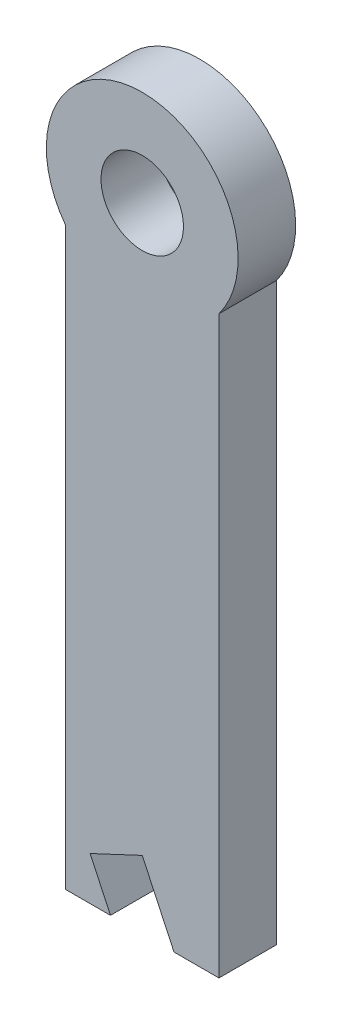
ISO-10303-21;
HEADER;
FILE_DESCRIPTION(('STEP AP214'),'2;1');
FILE_NAME('part.step','',(''),(''),'','','');
FILE_SCHEMA(('AUTOMOTIVE_DESIGN { 1 0 10303 214 1 1 1 1 }'));
ENDSEC;
DATA;
#1=APPLICATION_CONTEXT('core data for automotive mechanical design processes');
#2=APPLICATION_PROTOCOL_DEFINITION('international standard','automotive_design',2000,#1);
#3=PRODUCT_CONTEXT('',#1,'mechanical');
#4=PRODUCT('Part','Part','',(#3));
#5=PRODUCT_RELATED_PRODUCT_CATEGORY('part','',(#4));
#6=PRODUCT_DEFINITION_FORMATION('','',#4);
#7=PRODUCT_DEFINITION_CONTEXT('part definition',#1,'design');
#8=PRODUCT_DEFINITION('design','',#6,#7);
#9=PRODUCT_DEFINITION_SHAPE('','',#8);
#10=(LENGTH_UNIT() NAMED_UNIT(*) SI_UNIT(.MILLI.,.METRE.));
#11=(NAMED_UNIT(*) PLANE_ANGLE_UNIT() SI_UNIT($,.RADIAN.));
#12=(NAMED_UNIT(*) SI_UNIT($,.STERADIAN.) SOLID_ANGLE_UNIT());
#13=UNCERTAINTY_MEASURE_WITH_UNIT(LENGTH_MEASURE(1.E-05),#10,'distance_accuracy_value','');
#14=(GEOMETRIC_REPRESENTATION_CONTEXT(3) GLOBAL_UNCERTAINTY_ASSIGNED_CONTEXT((#13)) GLOBAL_UNIT_ASSIGNED_CONTEXT((#10,
#11,#12)) REPRESENTATION_CONTEXT('',''));
#15=CARTESIAN_POINT('',(0.,0.,0.));
#16=DIRECTION('',(0.,0.,1.));
#17=DIRECTION('',(1.,0.,0.));
#18=AXIS2_PLACEMENT_3D('',#15,#16,#17);
#19=CARTESIAN_POINT('',(4.,0.,3.));
#20=DIRECTION('',(1.,0.,0.));
#21=DIRECTION('',(0.,1.,0.));
#22=AXIS2_PLACEMENT_3D('',#19,#20,#21);
#23=PLANE('',#22);
#24=DIRECTION('',(0.,-1.,0.));
#25=VECTOR('',#24,1.);
#26=CARTESIAN_POINT('',(4.,0.,0.));
#27=LINE('',#26,#25);
#28=CARTESIAN_POINT('',(4.,-3.,0.));
#29=VERTEX_POINT('',#28);
#30=CARTESIAN_POINT('',(4.00000000000001,-33.,0.));
#31=VERTEX_POINT('',#30);
#32=EDGE_CURVE('E132',#29,#31,#27,.T.);
#33=ORIENTED_EDGE('',*,*,#32,.F.);
#34=DIRECTION('',(0.,0.,-1.));
#35=VECTOR('',#34,1.);
#36=CARTESIAN_POINT('',(4.,-3.,3.));
#37=LINE('',#36,#35);
#38=CARTESIAN_POINT('',(4.,-3.,3.));
#39=VERTEX_POINT('',#38);
#40=EDGE_CURVE('E11',#39,#29,#37,.T.);
#41=ORIENTED_EDGE('',*,*,#40,.F.);
#42=DIRECTION('',(0.,-1.,0.));
#43=VECTOR('',#42,1.);
#44=CARTESIAN_POINT('',(4.,0.,3.));
#45=LINE('',#44,#43);
#46=CARTESIAN_POINT('',(4.00000000000001,-33.,3.));
#47=VERTEX_POINT('',#46);
#48=EDGE_CURVE('E207',#39,#47,#45,.T.);
#49=ORIENTED_EDGE('',*,*,#48,.T.);
#50=DIRECTION('',(0.,0.,-1.));
#51=VECTOR('',#50,1.);
#52=CARTESIAN_POINT('',(4.00000000000001,-33.,3.));
#53=LINE('',#52,#51);
#54=EDGE_CURVE('E52',#47,#31,#53,.T.);
#55=ORIENTED_EDGE('',*,*,#54,.T.);
#56=EDGE_LOOP('',(#33,#41,#49,#55));
#57=FACE_BOUND('',#56,.T.);
#58=ADVANCED_FACE('F35',(#57),#23,.T.);
#59=CARTESIAN_POINT('',(0.,0.,3.));
#60=DIRECTION('',(0.,0.,-1.));
#61=DIRECTION('',(-1.,0.,0.));
#62=AXIS2_PLACEMENT_3D('',#59,#60,#61);
#63=CYLINDRICAL_SURFACE('',#62,5.);
#64=CARTESIAN_POINT('',(0.,0.,0.));
#65=DIRECTION('',(0.,0.,1.));
#66=DIRECTION('',(1.,0.,0.));
#67=AXIS2_PLACEMENT_3D('',#64,#65,#66);
#68=CIRCLE('',#67,5.);
#69=CARTESIAN_POINT('',(-4.,-2.99999999999999,0.));
#70=VERTEX_POINT('',#69);
#71=EDGE_CURVE('E134',#29,#70,#68,.T.);
#72=ORIENTED_EDGE('',*,*,#71,.T.);
#73=DIRECTION('',(0.,0.,-1.));
#74=VECTOR('',#73,1.);
#75=CARTESIAN_POINT('',(-4.,-2.99999999999999,3.));
#76=LINE('',#75,#74);
#77=CARTESIAN_POINT('',(-4.,-2.99999999999999,3.));
#78=VERTEX_POINT('',#77);
#79=EDGE_CURVE('E44',#78,#70,#76,.T.);
#80=ORIENTED_EDGE('',*,*,#79,.F.);
#81=CARTESIAN_POINT('',(0.,0.,3.));
#82=DIRECTION('',(0.,0.,1.));
#83=DIRECTION('',(1.,0.,0.));
#84=AXIS2_PLACEMENT_3D('',#81,#82,#83);
#85=CIRCLE('',#84,5.);
#86=EDGE_CURVE('E209',#39,#78,#85,.T.);
#87=ORIENTED_EDGE('',*,*,#86,.F.);
#88=ORIENTED_EDGE('',*,*,#40,.T.);
#89=EDGE_LOOP('',(#72,#80,#87,#88));
#90=FACE_BOUND('',#89,.T.);
#91=ADVANCED_FACE('F171',(#90),#63,.T.);
#92=CARTESIAN_POINT('',(-4.,0.,3.));
#93=DIRECTION('',(1.,0.,0.));
#94=DIRECTION('',(0.,1.,0.));
#95=AXIS2_PLACEMENT_3D('',#92,#93,#94);
#96=PLANE('',#95);
#97=DIRECTION('',(0.,-1.,0.));
#98=VECTOR('',#97,1.);
#99=CARTESIAN_POINT('',(-4.,0.,0.));
#100=LINE('',#99,#98);
#101=CARTESIAN_POINT('',(-4.,-33.,0.));
#102=VERTEX_POINT('',#101);
#103=EDGE_CURVE('E137',#70,#102,#100,.T.);
#104=ORIENTED_EDGE('',*,*,#103,.T.);
#105=DIRECTION('',(0.,0.,-1.));
#106=VECTOR('',#105,1.);
#107=CARTESIAN_POINT('',(-4.,-33.,3.));
#108=LINE('',#107,#106);
#109=CARTESIAN_POINT('',(-4.,-33.,3.));
#110=VERTEX_POINT('',#109);
#111=EDGE_CURVE('E159',#110,#102,#108,.T.);
#112=ORIENTED_EDGE('',*,*,#111,.F.);
#113=DIRECTION('',(0.,-1.,0.));
#114=VECTOR('',#113,1.);
#115=CARTESIAN_POINT('',(-4.,0.,3.));
#116=LINE('',#115,#114);
#117=EDGE_CURVE('E167',#78,#110,#116,.T.);
#118=ORIENTED_EDGE('',*,*,#117,.F.);
#119=ORIENTED_EDGE('',*,*,#79,.T.);
#120=EDGE_LOOP('',(#104,#112,#118,#119));
#121=FACE_BOUND('',#120,.T.);
#122=ADVANCED_FACE('F164',(#121),#96,.F.);
#123=CARTESIAN_POINT('',(-3.90820144314285E-13,-33.,3.));
#124=DIRECTION('',(0.,1.,0.));
#125=DIRECTION('',(-1.,0.,0.));
#126=AXIS2_PLACEMENT_3D('',#123,#124,#125);
#127=PLANE('',#126);
#128=DIRECTION('',(1.,0.,0.));
#129=VECTOR('',#128,1.);
#130=CARTESIAN_POINT('',(-3.90820144314285E-13,-33.,0.));
#131=LINE('',#130,#129);
#132=CARTESIAN_POINT('',(-1.65637977304673,-33.,0.));
#133=VERTEX_POINT('',#132);
#134=EDGE_CURVE('E140',#102,#133,#131,.T.);
#135=ORIENTED_EDGE('',*,*,#134,.T.);
#136=DIRECTION('',(0.,0.,-1.));
#137=VECTOR('',#136,1.);
#138=CARTESIAN_POINT('',(-1.65637977304673,-33.,3.));
#139=LINE('',#138,#137);
#140=CARTESIAN_POINT('',(-1.65637977304673,-33.,3.));
#141=VERTEX_POINT('',#140);
#142=EDGE_CURVE('E156',#141,#133,#139,.T.);
#143=ORIENTED_EDGE('',*,*,#142,.F.);
#144=DIRECTION('',(1.,0.,0.));
#145=VECTOR('',#144,1.);
#146=CARTESIAN_POINT('',(-3.90820144314285E-13,-33.,3.));
#147=LINE('',#146,#145);
#148=EDGE_CURVE('E214',#110,#141,#147,.T.);
#149=ORIENTED_EDGE('',*,*,#148,.F.);
#150=ORIENTED_EDGE('',*,*,#111,.T.);
#151=EDGE_LOOP('',(#135,#143,#149,#150));
#152=FACE_BOUND('',#151,.T.);
#153=ADVANCED_FACE('F182',(#152),#127,.F.);
#154=CARTESIAN_POINT('',(-14.0340352451924,-6.57319049991088,3.));
#155=DIRECTION('',(-0.905589421223677,-0.424155396249731,0.));
#156=DIRECTION('',(0.424155396249731,-0.905589421223677,0.));
#157=AXIS2_PLACEMENT_3D('',#154,#155,#156);
#158=PLANE('',#157);
#159=DIRECTION('',(-0.424155396249731,0.905589421223677,0.));
#160=VECTOR('',#159,1.);
#161=CARTESIAN_POINT('',(-14.0340352451924,-6.57319049991088,0.));
#162=LINE('',#161,#160);
#163=CARTESIAN_POINT('',(-2.71676826367106,-30.7360264469408,0.));
#164=VERTEX_POINT('',#163);
#165=EDGE_CURVE('E143',#133,#164,#162,.T.);
#166=ORIENTED_EDGE('',*,*,#165,.T.);
#167=DIRECTION('',(0.,0.,-1.));
#168=VECTOR('',#167,1.);
#169=CARTESIAN_POINT('',(-2.71676826367106,-30.7360264469408,3.));
#170=LINE('',#169,#168);
#171=CARTESIAN_POINT('',(-2.71676826367106,-30.7360264469408,3.));
#172=VERTEX_POINT('',#171);
#173=EDGE_CURVE('E111',#172,#164,#170,.T.);
#174=ORIENTED_EDGE('',*,*,#173,.F.);
#175=DIRECTION('',(-0.424155396249731,0.905589421223677,0.));
#176=VECTOR('',#175,1.);
#177=CARTESIAN_POINT('',(-14.0340352451924,-6.57319049991088,3.));
#178=LINE('',#177,#176);
#179=EDGE_CURVE('E120',#141,#172,#178,.T.);
#180=ORIENTED_EDGE('',*,*,#179,.F.);
#181=ORIENTED_EDGE('',*,*,#142,.T.);
#182=EDGE_LOOP('',(#166,#174,#180,#181));
#183=FACE_BOUND('',#182,.T.);
#184=ADVANCED_FACE('F185',(#183),#158,.F.);
#185=CARTESIAN_POINT('',(11.3172669815211,-24.1628359470303,3.));
#186=DIRECTION('',(0.424155396249719,-0.905589421223682,0.));
#187=DIRECTION('',(0.905589421223682,0.424155396249719,0.));
#188=AXIS2_PLACEMENT_3D('',#185,#186,#187);
#189=PLANE('',#188);
#190=DIRECTION('',(-0.905589421223682,-0.424155396249719,0.));
#191=VECTOR('',#190,1.);
#192=CARTESIAN_POINT('',(11.3172669815211,-24.1628359470303,0.));
#193=LINE('',#192,#191);
#194=CARTESIAN_POINT('',(0.,-29.4635602581916,0.));
#195=VERTEX_POINT('',#194);
#196=EDGE_CURVE('E107',#195,#164,#193,.T.);
#197=ORIENTED_EDGE('',*,*,#196,.F.);
#198=DIRECTION('',(0.,0.,-1.));
#199=VECTOR('',#198,1.);
#200=CARTESIAN_POINT('',(0.,-29.4635602581916,3.));
#201=LINE('',#200,#199);
#202=CARTESIAN_POINT('',(0.,-29.4635602581916,3.));
#203=VERTEX_POINT('',#202);
#204=EDGE_CURVE('E102',#203,#195,#201,.T.);
#205=ORIENTED_EDGE('',*,*,#204,.F.);
#206=DIRECTION('',(-0.905589421223682,-0.424155396249719,0.));
#207=VECTOR('',#206,1.);
#208=CARTESIAN_POINT('',(11.3172669815211,-24.1628359470303,3.));
#209=LINE('',#208,#207);
#210=EDGE_CURVE('E105',#203,#172,#209,.T.);
#211=ORIENTED_EDGE('',*,*,#210,.T.);
#212=ORIENTED_EDGE('',*,*,#173,.T.);
#213=EDGE_LOOP('',(#197,#205,#211,#212));
#214=FACE_BOUND('',#213,.T.);
#215=ADVANCED_FACE('F104',(#214),#189,.T.);
#216=CARTESIAN_POINT('',(-11.3172669815212,-5.3007243111615,3.));
#217=DIRECTION('',(-0.90558942122368,-0.424155396249724,0.));
#218=DIRECTION('',(0.424155396249724,-0.90558942122368,0.));
#219=AXIS2_PLACEMENT_3D('',#216,#217,#218);
#220=PLANE('',#219);
#221=DIRECTION('',(-0.424155396249724,0.90558942122368,0.));
#222=VECTOR('',#221,1.);
#223=CARTESIAN_POINT('',(-11.3172669815212,-5.3007243111615,0.));
#224=LINE('',#223,#222);
#225=CARTESIAN_POINT('',(1.65637977304672,-33.,0.));
#226=VERTEX_POINT('',#225);
#227=EDGE_CURVE('E147',#226,#195,#224,.T.);
#228=ORIENTED_EDGE('',*,*,#227,.F.);
#229=DIRECTION('',(0.,0.,-1.));
#230=VECTOR('',#229,1.);
#231=CARTESIAN_POINT('',(1.65637977304672,-33.,3.));
#232=LINE('',#231,#230);
#233=CARTESIAN_POINT('',(1.65637977304672,-33.,3.));
#234=VERTEX_POINT('',#233);
#235=EDGE_CURVE('E77',#234,#226,#232,.T.);
#236=ORIENTED_EDGE('',*,*,#235,.F.);
#237=DIRECTION('',(-0.424155396249724,0.90558942122368,0.));
#238=VECTOR('',#237,1.);
#239=CARTESIAN_POINT('',(-11.3172669815212,-5.3007243111615,3.));
#240=LINE('',#239,#238);
#241=EDGE_CURVE('E118',#234,#203,#240,.T.);
#242=ORIENTED_EDGE('',*,*,#241,.T.);
#243=ORIENTED_EDGE('',*,*,#204,.T.);
#244=EDGE_LOOP('',(#228,#236,#242,#243));
#245=FACE_BOUND('',#244,.T.);
#246=ADVANCED_FACE('F123',(#245),#220,.T.);
#247=CARTESIAN_POINT('',(0.,0.,3.));
#248=DIRECTION('',(0.,0.,-1.));
#249=DIRECTION('',(-1.,0.,0.));
#250=AXIS2_PLACEMENT_3D('',#247,#248,#249);
#251=CYLINDRICAL_SURFACE('',#250,2.15);
#252=CARTESIAN_POINT('',(0.,0.,3.));
#253=DIRECTION('',(0.,0.,1.));
#254=DIRECTION('',(1.,0.,0.));
#255=AXIS2_PLACEMENT_3D('',#252,#253,#254);
#256=CIRCLE('',#255,2.15);
#257=CARTESIAN_POINT('',(2.15,0.,3.));
#258=VERTEX_POINT('',#257);
#259=EDGE_CURVE('E152',#258,#258,#256,.T.);
#260=ORIENTED_EDGE('',*,*,#259,.T.);
#261=EDGE_LOOP('',(#260));
#262=FACE_BOUND('',#261,.T.);
#263=CARTESIAN_POINT('',(0.,0.,0.));
#264=DIRECTION('',(0.,0.,1.));
#265=DIRECTION('',(1.,0.,0.));
#266=AXIS2_PLACEMENT_3D('',#263,#264,#265);
#267=CIRCLE('',#266,2.15);
#268=CARTESIAN_POINT('',(2.15,0.,0.));
#269=VERTEX_POINT('',#268);
#270=EDGE_CURVE('E129',#269,#269,#267,.T.);
#271=ORIENTED_EDGE('',*,*,#270,.F.);
#272=EDGE_LOOP('',(#271));
#273=FACE_BOUND('',#272,.T.);
#274=ADVANCED_FACE('F37',(#262,#273),#251,.F.);
#275=CARTESIAN_POINT('',(0.,-33.,3.));
#276=DIRECTION('',(0.,-1.,0.));
#277=DIRECTION('',(0.,0.,-1.));
#278=AXIS2_PLACEMENT_3D('',#275,#276,#277);
#279=PLANE('',#278);
#280=DIRECTION('',(-1.,0.,0.));
#281=VECTOR('',#280,1.);
#282=CARTESIAN_POINT('',(0.,-33.,0.));
#283=LINE('',#282,#281);
#284=EDGE_CURVE('E149',#31,#226,#283,.T.);
#285=ORIENTED_EDGE('',*,*,#284,.F.);
#286=ORIENTED_EDGE('',*,*,#54,.F.);
#287=DIRECTION('',(-1.,0.,0.));
#288=VECTOR('',#287,1.);
#289=CARTESIAN_POINT('',(0.,-33.,3.));
#290=LINE('',#289,#288);
#291=EDGE_CURVE('E124',#47,#234,#290,.T.);
#292=ORIENTED_EDGE('',*,*,#291,.T.);
#293=ORIENTED_EDGE('',*,*,#235,.T.);
#294=EDGE_LOOP('',(#285,#286,#292,#293));
#295=FACE_BOUND('',#294,.T.);
#296=ADVANCED_FACE('F194',(#295),#279,.T.);
#297=CARTESIAN_POINT('',(0.,0.,3.));
#298=DIRECTION('',(0.,0.,1.));
#299=DIRECTION('',(1.,0.,0.));
#300=AXIS2_PLACEMENT_3D('',#297,#298,#299);
#301=PLANE('',#300);
#302=ORIENTED_EDGE('',*,*,#259,.F.);
#303=EDGE_LOOP('',(#302));
#304=FACE_BOUND('',#303,.T.);
#305=ORIENTED_EDGE('',*,*,#48,.F.);
#306=ORIENTED_EDGE('',*,*,#86,.T.);
#307=ORIENTED_EDGE('',*,*,#117,.T.);
#308=ORIENTED_EDGE('',*,*,#148,.T.);
#309=ORIENTED_EDGE('',*,*,#179,.T.);
#310=ORIENTED_EDGE('',*,*,#210,.F.);
#311=ORIENTED_EDGE('',*,*,#241,.F.);
#312=ORIENTED_EDGE('',*,*,#291,.F.);
#313=EDGE_LOOP('',(#305,#306,#307,#308,#309,#310,#311,#312));
#314=FACE_BOUND('',#313,.T.);
#315=ADVANCED_FACE('F116',(#304,#314),#301,.T.);
#316=CARTESIAN_POINT('',(0.,0.,0.));
#317=DIRECTION('',(0.,0.,1.));
#318=DIRECTION('',(1.,0.,0.));
#319=AXIS2_PLACEMENT_3D('',#316,#317,#318);
#320=PLANE('',#319);
#321=ORIENTED_EDGE('',*,*,#270,.T.);
#322=EDGE_LOOP('',(#321));
#323=FACE_BOUND('',#322,.T.);
#324=ORIENTED_EDGE('',*,*,#32,.T.);
#325=ORIENTED_EDGE('',*,*,#284,.T.);
#326=ORIENTED_EDGE('',*,*,#227,.T.);
#327=ORIENTED_EDGE('',*,*,#196,.T.);
#328=ORIENTED_EDGE('',*,*,#165,.F.);
#329=ORIENTED_EDGE('',*,*,#134,.F.);
#330=ORIENTED_EDGE('',*,*,#103,.F.);
#331=ORIENTED_EDGE('',*,*,#71,.F.);
#332=EDGE_LOOP('',(#324,#325,#326,#327,#328,#329,#330,#331));
#333=FACE_BOUND('',#332,.T.);
#334=ADVANCED_FACE('F173',(#323,#333),#320,.F.);
#335=CLOSED_SHELL('',(#58,#91,#122,#153,#184,#215,#246,#274,#296,#315,#334));
#336=MANIFOLD_SOLID_BREP('B2',#335);
#337=ADVANCED_BREP_SHAPE_REPRESENTATION('',(#18,#336),#14);
#338=SHAPE_DEFINITION_REPRESENTATION(#9,#337);
ENDSEC;
END-ISO-10303-21;
